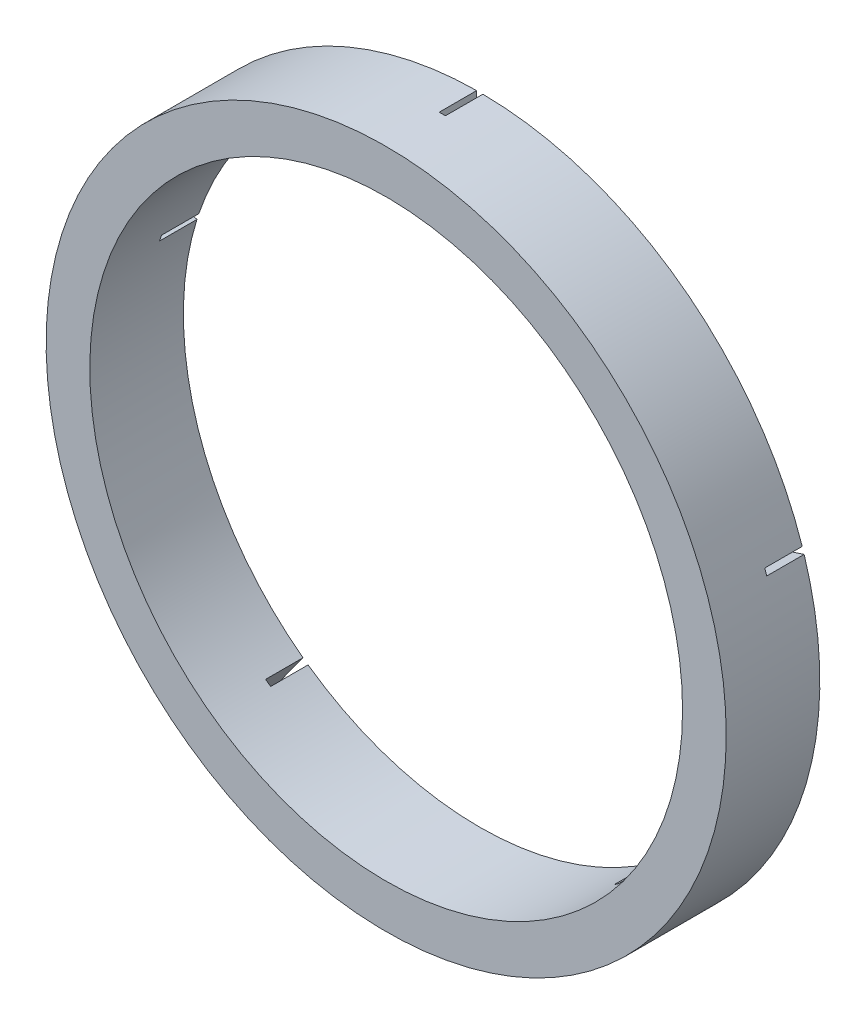
ISO-10303-21;
HEADER;
FILE_DESCRIPTION(('STEP AP214'),'2;1');
FILE_NAME('part.step','',(''),(''),'','','');
FILE_SCHEMA(('AUTOMOTIVE_DESIGN { 1 0 10303 214 1 1 1 1 }'));
ENDSEC;
DATA;
#1=APPLICATION_CONTEXT('core data for automotive mechanical design processes');
#2=APPLICATION_PROTOCOL_DEFINITION('international standard','automotive_design',2000,#1);
#3=PRODUCT_CONTEXT('',#1,'mechanical');
#4=PRODUCT('Part','Part','',(#3));
#5=PRODUCT_RELATED_PRODUCT_CATEGORY('part','',(#4));
#6=PRODUCT_DEFINITION_FORMATION('','',#4);
#7=PRODUCT_DEFINITION_CONTEXT('part definition',#1,'design');
#8=PRODUCT_DEFINITION('design','',#6,#7);
#9=PRODUCT_DEFINITION_SHAPE('','',#8);
#10=(LENGTH_UNIT() NAMED_UNIT(*) SI_UNIT(.MILLI.,.METRE.));
#11=(NAMED_UNIT(*) PLANE_ANGLE_UNIT() SI_UNIT($,.RADIAN.));
#12=(NAMED_UNIT(*) SI_UNIT($,.STERADIAN.) SOLID_ANGLE_UNIT());
#13=UNCERTAINTY_MEASURE_WITH_UNIT(LENGTH_MEASURE(1.E-05),#10,'distance_accuracy_value','');
#14=(GEOMETRIC_REPRESENTATION_CONTEXT(3) GLOBAL_UNCERTAINTY_ASSIGNED_CONTEXT((#13)) GLOBAL_UNIT_ASSIGNED_CONTEXT((#10,
#11,#12)) REPRESENTATION_CONTEXT('',''));
#15=CARTESIAN_POINT('',(0.,0.,0.));
#16=DIRECTION('',(0.,0.,1.));
#17=DIRECTION('',(1.,0.,0.));
#18=AXIS2_PLACEMENT_3D('',#15,#16,#17);
#19=CARTESIAN_POINT('',(0.,0.,15.));
#20=DIRECTION('',(0.,0.,-1.));
#21=DIRECTION('',(-1.,0.,0.));
#22=AXIS2_PLACEMENT_3D('',#19,#20,#21);
#23=CYLINDRICAL_SURFACE('',#22,54.5);
#24=CARTESIAN_POINT('',(0.,0.,15.));
#25=DIRECTION('',(0.,0.,1.));
#26=DIRECTION('',(1.,0.,0.));
#27=AXIS2_PLACEMENT_3D('',#24,#25,#26);
#28=CIRCLE('',#27,54.5);
#29=CARTESIAN_POINT('',(54.5,0.,15.));
#30=VERTEX_POINT('',#29);
#31=EDGE_CURVE('E203',#30,#30,#28,.T.);
#32=ORIENTED_EDGE('',*,*,#31,.F.);
#33=EDGE_LOOP('',(#32));
#34=FACE_BOUND('',#33,.T.);
#35=DIRECTION('',(0.,0.,-1.));
#36=VECTOR('',#35,1.);
#37=CARTESIAN_POINT('',(0.5,54.4977063737548,15.));
#38=LINE('',#37,#36);
#39=CARTESIAN_POINT('',(0.5,54.4977063737548,6.));
#40=VERTEX_POINT('',#39);
#41=CARTESIAN_POINT('',(0.5,54.4977063737548,0.));
#42=VERTEX_POINT('',#41);
#43=EDGE_CURVE('E301',#40,#42,#38,.T.);
#44=ORIENTED_EDGE('',*,*,#43,.F.);
#45=CARTESIAN_POINT('',(0.,0.,6.));
#46=DIRECTION('',(0.,0.,-1.));
#47=DIRECTION('',(-1.,0.,0.));
#48=AXIS2_PLACEMENT_3D('',#45,#46,#47);
#49=CIRCLE('',#48,54.5);
#50=CARTESIAN_POINT('',(-0.5,54.4977063737548,6.));
#51=VERTEX_POINT('',#50);
#52=EDGE_CURVE('E186',#51,#40,#49,.T.);
#53=ORIENTED_EDGE('',*,*,#52,.F.);
#54=DIRECTION('',(0.,0.,-1.));
#55=VECTOR('',#54,1.);
#56=CARTESIAN_POINT('',(-0.5,54.4977063737548,15.));
#57=LINE('',#56,#55);
#58=CARTESIAN_POINT('',(-0.5,54.4977063737548,0.));
#59=VERTEX_POINT('',#58);
#60=EDGE_CURVE('E173',#51,#59,#57,.T.);
#61=ORIENTED_EDGE('',*,*,#60,.T.);
#62=CARTESIAN_POINT('',(0.,0.,0.));
#63=DIRECTION('',(0.,0.,1.));
#64=DIRECTION('',(1.,0.,0.));
#65=AXIS2_PLACEMENT_3D('',#62,#63,#64);
#66=CIRCLE('',#65,54.5);
#67=CARTESIAN_POINT('',(-51.6758902727109,17.316245682097,0.));
#68=VERTEX_POINT('',#67);
#69=EDGE_CURVE('E184',#59,#68,#66,.T.);
#70=ORIENTED_EDGE('',*,*,#69,.T.);
#71=DIRECTION('',(0.,0.,-1.));
#72=VECTOR('',#71,1.);
#73=CARTESIAN_POINT('',(-51.6758902727109,17.316245682097,15.));
#74=LINE('',#73,#72);
#75=CARTESIAN_POINT('',(-51.6758902727109,17.316245682097,6.));
#76=VERTEX_POINT('',#75);
#77=EDGE_CURVE('E320',#76,#68,#74,.T.);
#78=ORIENTED_EDGE('',*,*,#77,.F.);
#79=CARTESIAN_POINT('',(0.,0.,6.));
#80=DIRECTION('',(0.,0.,-1.));
#81=DIRECTION('',(-1.,0.,0.));
#82=AXIS2_PLACEMENT_3D('',#79,#80,#81);
#83=CIRCLE('',#82,54.5);
#84=CARTESIAN_POINT('',(-51.9849072670859,16.3651891658019,6.));
#85=VERTEX_POINT('',#84);
#86=EDGE_CURVE('E322',#85,#76,#83,.T.);
#87=ORIENTED_EDGE('',*,*,#86,.F.);
#88=DIRECTION('',(0.,0.,-1.));
#89=VECTOR('',#88,1.);
#90=CARTESIAN_POINT('',(-51.9849072670859,16.3651891658019,15.));
#91=LINE('',#90,#89);
#92=CARTESIAN_POINT('',(-51.9849072670859,16.3651891658019,0.));
#93=VERTEX_POINT('',#92);
#94=EDGE_CURVE('E314',#85,#93,#91,.T.);
#95=ORIENTED_EDGE('',*,*,#94,.T.);
#96=CARTESIAN_POINT('',(-32.4374565874536,-43.7956779846718,0.));
#97=VERTEX_POINT('',#96);
#98=EDGE_CURVE('E194',#93,#97,#66,.T.);
#99=ORIENTED_EDGE('',*,*,#98,.T.);
#100=DIRECTION('',(0.,0.,-1.));
#101=VECTOR('',#100,1.);
#102=CARTESIAN_POINT('',(-32.4374565874536,-43.7956779846718,6.));
#103=LINE('',#102,#101);
#104=CARTESIAN_POINT('',(-32.4374565874536,-43.7956779846718,6.));
#105=VERTEX_POINT('',#104);
#106=EDGE_CURVE('E265',#105,#97,#103,.T.);
#107=ORIENTED_EDGE('',*,*,#106,.F.);
#108=CARTESIAN_POINT('',(0.,0.,6.));
#109=DIRECTION('',(0.,0.,-1.));
#110=DIRECTION('',(-1.,0.,0.));
#111=AXIS2_PLACEMENT_3D('',#108,#109,#110);
#112=CIRCLE('',#111,54.5);
#113=CARTESIAN_POINT('',(-31.6284395930788,-44.3834632369644,6.));
#114=VERTEX_POINT('',#113);
#115=EDGE_CURVE('E260',#114,#105,#112,.T.);
#116=ORIENTED_EDGE('',*,*,#115,.F.);
#117=DIRECTION('',(0.,0.,-1.));
#118=VECTOR('',#117,1.);
#119=CARTESIAN_POINT('',(-31.6284395930788,-44.3834632369644,6.));
#120=LINE('',#119,#118);
#121=CARTESIAN_POINT('',(-31.6284395930788,-44.3834632369644,0.));
#122=VERTEX_POINT('',#121);
#123=EDGE_CURVE('E269',#114,#122,#120,.T.);
#124=ORIENTED_EDGE('',*,*,#123,.T.);
#125=CARTESIAN_POINT('',(31.6284395930634,-44.3834632369753,0.));
#126=VERTEX_POINT('',#125);
#127=EDGE_CURVE('E196',#122,#126,#66,.T.);
#128=ORIENTED_EDGE('',*,*,#127,.T.);
#129=DIRECTION('',(0.,0.,-1.));
#130=VECTOR('',#129,1.);
#131=CARTESIAN_POINT('',(31.6284395930634,-44.3834632369753,15.));
#132=LINE('',#131,#130);
#133=CARTESIAN_POINT('',(31.6284395930634,-44.3834632369753,6.));
#134=VERTEX_POINT('',#133);
#135=EDGE_CURVE('E229',#134,#126,#132,.T.);
#136=ORIENTED_EDGE('',*,*,#135,.F.);
#137=CARTESIAN_POINT('',(0.,0.,6.));
#138=DIRECTION('',(0.,0.,-1.));
#139=DIRECTION('',(-1.,0.,0.));
#140=AXIS2_PLACEMENT_3D('',#137,#138,#139);
#141=CIRCLE('',#140,54.5);
#142=CARTESIAN_POINT('',(32.4374565874385,-43.7956779846829,6.));
#143=VERTEX_POINT('',#142);
#144=EDGE_CURVE('E330',#143,#134,#141,.T.);
#145=ORIENTED_EDGE('',*,*,#144,.F.);
#146=DIRECTION('',(0.,0.,-1.));
#147=VECTOR('',#146,1.);
#148=CARTESIAN_POINT('',(32.4374565874385,-43.795677984683,15.));
#149=LINE('',#148,#147);
#150=CARTESIAN_POINT('',(32.4374565874385,-43.7956779846829,0.));
#151=VERTEX_POINT('',#150);
#152=EDGE_CURVE('E216',#143,#151,#149,.T.);
#153=ORIENTED_EDGE('',*,*,#152,.T.);
#154=CARTESIAN_POINT('',(51.984907267088,16.3651891657951,0.));
#155=VERTEX_POINT('',#154);
#156=EDGE_CURVE('E198',#151,#155,#66,.T.);
#157=ORIENTED_EDGE('',*,*,#156,.T.);
#158=DIRECTION('',(0.,0.,-1.));
#159=VECTOR('',#158,1.);
#160=CARTESIAN_POINT('',(51.984907267088,16.3651891657951,6.));
#161=LINE('',#160,#159);
#162=CARTESIAN_POINT('',(51.984907267088,16.3651891657951,6.));
#163=VERTEX_POINT('',#162);
#164=EDGE_CURVE('E214',#163,#155,#161,.T.);
#165=ORIENTED_EDGE('',*,*,#164,.F.);
#166=CARTESIAN_POINT('',(0.,0.,6.));
#167=DIRECTION('',(0.,0.,-1.));
#168=DIRECTION('',(-1.,0.,0.));
#169=AXIS2_PLACEMENT_3D('',#166,#167,#168);
#170=CIRCLE('',#169,54.5);
#171=CARTESIAN_POINT('',(51.6758902727132,17.3162456820902,6.));
#172=VERTEX_POINT('',#171);
#173=EDGE_CURVE('E242',#172,#163,#170,.T.);
#174=ORIENTED_EDGE('',*,*,#173,.F.);
#175=DIRECTION('',(0.,0.,-1.));
#176=VECTOR('',#175,1.);
#177=CARTESIAN_POINT('',(51.6758902727132,17.3162456820902,6.));
#178=LINE('',#177,#176);
#179=CARTESIAN_POINT('',(51.6758902727132,17.3162456820902,0.));
#180=VERTEX_POINT('',#179);
#181=EDGE_CURVE('E228',#172,#180,#178,.T.);
#182=ORIENTED_EDGE('',*,*,#181,.T.);
#183=EDGE_CURVE('E193',#180,#42,#66,.T.);
#184=ORIENTED_EDGE('',*,*,#183,.T.);
#185=EDGE_LOOP('',(#44,#53,#61,#70,#78,#87,#95,#99,#107,#116,#124,#128,#136,#145,#153,#157,#165,
#174,#182,#184));
#186=FACE_BOUND('',#185,.T.);
#187=ADVANCED_FACE('F35',(#34,#186),#23,.T.);
#188=CARTESIAN_POINT('',(0.,0.,15.));
#189=DIRECTION('',(0.,0.,-1.));
#190=DIRECTION('',(-1.,0.,0.));
#191=AXIS2_PLACEMENT_3D('',#188,#189,#190);
#192=CYLINDRICAL_SURFACE('',#191,47.5);
#193=CARTESIAN_POINT('',(0.,0.,15.));
#194=DIRECTION('',(0.,0.,1.));
#195=DIRECTION('',(1.,0.,0.));
#196=AXIS2_PLACEMENT_3D('',#193,#194,#195);
#197=CIRCLE('',#196,47.5);
#198=CARTESIAN_POINT('',(47.5,0.,15.));
#199=VERTEX_POINT('',#198);
#200=EDGE_CURVE('E199',#199,#199,#197,.T.);
#201=ORIENTED_EDGE('',*,*,#200,.T.);
#202=EDGE_LOOP('',(#201));
#203=FACE_BOUND('',#202,.T.);
#204=CARTESIAN_POINT('',(0.,0.,6.));
#205=DIRECTION('',(0.,0.,-1.));
#206=DIRECTION('',(-1.,0.,0.));
#207=AXIS2_PLACEMENT_3D('',#204,#205,#206);
#208=CIRCLE('',#207,47.5);
#209=CARTESIAN_POINT('',(-0.5,47.4973683481517,6.));
#210=VERTEX_POINT('',#209);
#211=CARTESIAN_POINT('',(0.5,47.4973683481517,6.));
#212=VERTEX_POINT('',#211);
#213=EDGE_CURVE('E11',#210,#212,#208,.T.);
#214=ORIENTED_EDGE('',*,*,#213,.T.);
#215=DIRECTION('',(0.,0.,-1.));
#216=VECTOR('',#215,1.);
#217=CARTESIAN_POINT('',(0.5,47.4973683481517,15.));
#218=LINE('',#217,#216);
#219=CARTESIAN_POINT('',(0.5,47.4973683481517,0.));
#220=VERTEX_POINT('',#219);
#221=EDGE_CURVE('E187',#212,#220,#218,.T.);
#222=ORIENTED_EDGE('',*,*,#221,.T.);
#223=CARTESIAN_POINT('',(0.,0.,0.));
#224=DIRECTION('',(0.,0.,1.));
#225=DIRECTION('',(1.,0.,0.));
#226=AXIS2_PLACEMENT_3D('',#223,#224,#225);
#227=CIRCLE('',#226,47.5);
#228=CARTESIAN_POINT('',(45.0181731771945,15.1530222658097,0.));
#229=VERTEX_POINT('',#228);
#230=EDGE_CURVE('E280',#229,#220,#227,.T.);
#231=ORIENTED_EDGE('',*,*,#230,.F.);
#232=DIRECTION('',(0.,0.,-1.));
#233=VECTOR('',#232,1.);
#234=CARTESIAN_POINT('',(45.0181731771945,15.1530222658097,6.));
#235=LINE('',#234,#233);
#236=CARTESIAN_POINT('',(45.0181731771945,15.1530222658097,6.));
#237=VERTEX_POINT('',#236);
#238=EDGE_CURVE('E297',#237,#229,#235,.T.);
#239=ORIENTED_EDGE('',*,*,#238,.F.);
#240=CARTESIAN_POINT('',(0.,0.,6.));
#241=DIRECTION('',(0.,0.,-1.));
#242=DIRECTION('',(-1.,0.,0.));
#243=AXIS2_PLACEMENT_3D('',#240,#241,#242);
#244=CIRCLE('',#243,47.5);
#245=CARTESIAN_POINT('',(45.3271901715694,14.2019657495145,6.));
#246=VERTEX_POINT('',#245);
#247=EDGE_CURVE('E248',#246,#237,#244,.F.);
#248=ORIENTED_EDGE('',*,*,#247,.F.);
#249=DIRECTION('',(0.,0.,-1.));
#250=VECTOR('',#249,1.);
#251=CARTESIAN_POINT('',(45.3271901715694,14.2019657495145,6.));
#252=LINE('',#251,#250);
#253=CARTESIAN_POINT('',(45.3271901715694,14.2019657495145,0.));
#254=VERTEX_POINT('',#253);
#255=EDGE_CURVE('E245',#246,#254,#252,.T.);
#256=ORIENTED_EDGE('',*,*,#255,.T.);
#257=CARTESIAN_POINT('',(28.3227611349267,-38.1322855556008,0.));
#258=VERTEX_POINT('',#257);
#259=EDGE_CURVE('E233',#258,#254,#227,.T.);
#260=ORIENTED_EDGE('',*,*,#259,.F.);
#261=DIRECTION('',(0.,0.,-1.));
#262=VECTOR('',#261,1.);
#263=CARTESIAN_POINT('',(28.3227611349267,-38.1322855556008,15.));
#264=LINE('',#263,#262);
#265=CARTESIAN_POINT('',(28.3227611349267,-38.1322855556008,6.));
#266=VERTEX_POINT('',#265);
#267=EDGE_CURVE('E347',#266,#258,#264,.T.);
#268=ORIENTED_EDGE('',*,*,#267,.F.);
#269=CARTESIAN_POINT('',(0.,0.,6.));
#270=DIRECTION('',(0.,0.,-1.));
#271=DIRECTION('',(-1.,0.,0.));
#272=AXIS2_PLACEMENT_3D('',#269,#270,#271);
#273=CIRCLE('',#272,47.5);
#274=CARTESIAN_POINT('',(27.5137441405517,-38.7200708078931,6.));
#275=VERTEX_POINT('',#274);
#276=EDGE_CURVE('E208',#266,#275,#273,.T.);
#277=ORIENTED_EDGE('',*,*,#276,.T.);
#278=DIRECTION('',(0.,0.,-1.));
#279=VECTOR('',#278,1.);
#280=CARTESIAN_POINT('',(27.5137441405517,-38.7200708078932,15.));
#281=LINE('',#280,#279);
#282=CARTESIAN_POINT('',(27.5137441405517,-38.7200708078931,0.));
#283=VERTEX_POINT('',#282);
#284=EDGE_CURVE('E351',#275,#283,#281,.T.);
#285=ORIENTED_EDGE('',*,*,#284,.T.);
#286=CARTESIAN_POINT('',(-27.513744140567,-38.7200708078823,0.));
#287=VERTEX_POINT('',#286);
#288=EDGE_CURVE('E277',#287,#283,#227,.T.);
#289=ORIENTED_EDGE('',*,*,#288,.F.);
#290=DIRECTION('',(0.,0.,-1.));
#291=VECTOR('',#290,1.);
#292=CARTESIAN_POINT('',(-27.513744140567,-38.7200708078823,6.));
#293=LINE('',#292,#291);
#294=CARTESIAN_POINT('',(-27.513744140567,-38.7200708078823,6.));
#295=VERTEX_POINT('',#294);
#296=EDGE_CURVE('E271',#295,#287,#293,.T.);
#297=ORIENTED_EDGE('',*,*,#296,.F.);
#298=CARTESIAN_POINT('',(0.,0.,6.));
#299=DIRECTION('',(0.,0.,-1.));
#300=DIRECTION('',(-1.,0.,0.));
#301=AXIS2_PLACEMENT_3D('',#298,#299,#300);
#302=CIRCLE('',#301,47.5);
#303=CARTESIAN_POINT('',(-28.3227611349418,-38.1322855555896,6.));
#304=VERTEX_POINT('',#303);
#305=EDGE_CURVE('E254',#304,#295,#302,.F.);
#306=ORIENTED_EDGE('',*,*,#305,.F.);
#307=DIRECTION('',(0.,0.,-1.));
#308=VECTOR('',#307,1.);
#309=CARTESIAN_POINT('',(-28.3227611349418,-38.1322855555896,6.));
#310=LINE('',#309,#308);
#311=CARTESIAN_POINT('',(-28.3227611349418,-38.1322855555896,0.));
#312=VERTEX_POINT('',#311);
#313=EDGE_CURVE('E262',#304,#312,#310,.T.);
#314=ORIENTED_EDGE('',*,*,#313,.T.);
#315=CARTESIAN_POINT('',(-45.3271901715673,14.2019657495214,0.));
#316=VERTEX_POINT('',#315);
#317=EDGE_CURVE('E268',#316,#312,#227,.T.);
#318=ORIENTED_EDGE('',*,*,#317,.F.);
#319=DIRECTION('',(0.,0.,-1.));
#320=VECTOR('',#319,1.);
#321=CARTESIAN_POINT('',(-45.3271901715673,14.2019657495214,15.));
#322=LINE('',#321,#320);
#323=CARTESIAN_POINT('',(-45.3271901715673,14.2019657495214,6.));
#324=VERTEX_POINT('',#323);
#325=EDGE_CURVE('E57',#324,#316,#322,.T.);
#326=ORIENTED_EDGE('',*,*,#325,.F.);
#327=CARTESIAN_POINT('',(0.,0.,6.));
#328=DIRECTION('',(0.,0.,-1.));
#329=DIRECTION('',(-1.,0.,0.));
#330=AXIS2_PLACEMENT_3D('',#327,#328,#329);
#331=CIRCLE('',#330,47.5);
#332=CARTESIAN_POINT('',(-45.0181731771922,15.1530222658165,6.));
#333=VERTEX_POINT('',#332);
#334=EDGE_CURVE('E178',#324,#333,#331,.T.);
#335=ORIENTED_EDGE('',*,*,#334,.T.);
#336=DIRECTION('',(0.,0.,-1.));
#337=VECTOR('',#336,1.);
#338=CARTESIAN_POINT('',(-45.0181731771922,15.1530222658165,15.));
#339=LINE('',#338,#337);
#340=CARTESIAN_POINT('',(-45.0181731771922,15.1530222658165,0.));
#341=VERTEX_POINT('',#340);
#342=EDGE_CURVE('E317',#333,#341,#339,.T.);
#343=ORIENTED_EDGE('',*,*,#342,.T.);
#344=CARTESIAN_POINT('',(-0.5,47.4973683481517,0.));
#345=VERTEX_POINT('',#344);
#346=EDGE_CURVE('E279',#345,#341,#227,.T.);
#347=ORIENTED_EDGE('',*,*,#346,.F.);
#348=DIRECTION('',(0.,0.,-1.));
#349=VECTOR('',#348,1.);
#350=CARTESIAN_POINT('',(-0.5,47.4973683481517,15.));
#351=LINE('',#350,#349);
#352=EDGE_CURVE('E49',#210,#345,#351,.T.);
#353=ORIENTED_EDGE('',*,*,#352,.F.);
#354=EDGE_LOOP('',(#214,#222,#231,#239,#248,#256,#260,#268,#277,#285,#289,#297,#306,#314,#318,
#326,#335,#343,#347,#353));
#355=FACE_BOUND('',#354,.T.);
#356=ADVANCED_FACE('F295',(#203,#355),#192,.F.);
#357=CARTESIAN_POINT('',(0.,0.,0.));
#358=DIRECTION('',(0.,0.,1.));
#359=DIRECTION('',(1.,0.,0.));
#360=AXIS2_PLACEMENT_3D('',#357,#358,#359);
#361=PLANE('',#360);
#362=DIRECTION('',(0.,-1.,0.));
#363=VECTOR('',#362,1.);
#364=CARTESIAN_POINT('',(0.5,0.,0.));
#365=LINE('',#364,#363);
#366=EDGE_CURVE('E42',#42,#220,#365,.T.);
#367=ORIENTED_EDGE('',*,*,#366,.F.);
#368=ORIENTED_EDGE('',*,*,#183,.F.);
#369=DIRECTION('',(0.951056516295154,0.309016994374947,0.));
#370=VECTOR('',#369,1.);
#371=CARTESIAN_POINT('',(-0.154508497186339,0.475528258144085,0.));
#372=LINE('',#371,#370);
#373=EDGE_CURVE('E235',#229,#180,#372,.T.);
#374=ORIENTED_EDGE('',*,*,#373,.F.);
#375=ORIENTED_EDGE('',*,*,#230,.T.);
#376=EDGE_LOOP('',(#367,#368,#374,#375));
#377=FACE_BOUND('',#376,.T.);
#378=ADVANCED_FACE('F290',(#377),#361,.F.);
#379=ORIENTED_EDGE('',*,*,#69,.F.);
#380=DIRECTION('',(0.,-1.,0.));
#381=VECTOR('',#380,1.);
#382=CARTESIAN_POINT('',(-0.5,0.,0.));
#383=LINE('',#382,#381);
#384=EDGE_CURVE('E170',#59,#345,#383,.T.);
#385=ORIENTED_EDGE('',*,*,#384,.T.);
#386=ORIENTED_EDGE('',*,*,#346,.T.);
#387=DIRECTION('',(0.951056516295154,-0.309016994374947,0.));
#388=VECTOR('',#387,1.);
#389=CARTESIAN_POINT('',(0.154508497188563,0.475528258150928,0.));
#390=LINE('',#389,#388);
#391=EDGE_CURVE('E192',#68,#341,#390,.T.);
#392=ORIENTED_EDGE('',*,*,#391,.F.);
#393=EDGE_LOOP('',(#379,#385,#386,#392));
#394=FACE_BOUND('',#393,.T.);
#395=ADVANCED_FACE('F190',(#394),#361,.F.);
#396=DIRECTION('',(0.587785252292473,-0.809016994374948,0.));
#397=VECTOR('',#396,1.);
#398=CARTESIAN_POINT('',(26.5117778106465,-37.3409824664908,0.));
#399=LINE('',#398,#397);
#400=EDGE_CURVE('E325',#283,#126,#399,.T.);
#401=ORIENTED_EDGE('',*,*,#400,.T.);
#402=ORIENTED_EDGE('',*,*,#127,.F.);
#403=DIRECTION('',(-0.587785252292473,-0.809016994374947,0.));
#404=VECTOR('',#403,1.);
#405=CARTESIAN_POINT('',(0.404508497179912,-0.293892626140743,0.));
#406=LINE('',#405,#404);
#407=EDGE_CURVE('E238',#287,#122,#406,.T.);
#408=ORIENTED_EDGE('',*,*,#407,.F.);
#409=ORIENTED_EDGE('',*,*,#288,.T.);
#410=EDGE_LOOP('',(#401,#402,#408,#409));
#411=FACE_BOUND('',#410,.T.);
#412=ADVANCED_FACE('F389',(#411),#361,.F.);
#413=ORIENTED_EDGE('',*,*,#156,.F.);
#414=DIRECTION('',(0.587785252292473,-0.809016994374947,0.));
#415=VECTOR('',#414,1.);
#416=CARTESIAN_POINT('',(27.3207948050214,-36.7531972141983,0.));
#417=LINE('',#416,#415);
#418=EDGE_CURVE('E327',#258,#151,#417,.T.);
#419=ORIENTED_EDGE('',*,*,#418,.F.);
#420=ORIENTED_EDGE('',*,*,#259,.T.);
#421=DIRECTION('',(0.951056516295154,0.309016994374948,0.));
#422=VECTOR('',#421,1.);
#423=CARTESIAN_POINT('',(0.154508497188614,-0.475528258151086,0.));
#424=LINE('',#423,#422);
#425=EDGE_CURVE('E224',#254,#155,#424,.T.);
#426=ORIENTED_EDGE('',*,*,#425,.T.);
#427=EDGE_LOOP('',(#413,#419,#420,#426));
#428=FACE_BOUND('',#427,.T.);
#429=ADVANCED_FACE('F231',(#428),#361,.F.);
#430=ORIENTED_EDGE('',*,*,#98,.F.);
#431=DIRECTION('',(0.951056516295154,-0.309016994374948,0.));
#432=VECTOR('',#431,1.);
#433=CARTESIAN_POINT('',(-0.154508497186391,-0.475528258144245,0.));
#434=LINE('',#433,#432);
#435=EDGE_CURVE('E353',#93,#316,#434,.T.);
#436=ORIENTED_EDGE('',*,*,#435,.T.);
#437=ORIENTED_EDGE('',*,*,#317,.T.);
#438=DIRECTION('',(-0.587785252292474,-0.809016994374947,0.));
#439=VECTOR('',#438,1.);
#440=CARTESIAN_POINT('',(-0.40450849719501,0.293892626151713,0.));
#441=LINE('',#440,#439);
#442=EDGE_CURVE('E234',#312,#97,#441,.T.);
#443=ORIENTED_EDGE('',*,*,#442,.T.);
#444=EDGE_LOOP('',(#430,#436,#437,#443));
#445=FACE_BOUND('',#444,.T.);
#446=ADVANCED_FACE('F379',(#445),#361,.F.);
#447=CARTESIAN_POINT('',(0.,0.,15.));
#448=DIRECTION('',(0.,0.,1.));
#449=DIRECTION('',(1.,0.,0.));
#450=AXIS2_PLACEMENT_3D('',#447,#448,#449);
#451=PLANE('',#450);
#452=ORIENTED_EDGE('',*,*,#31,.T.);
#453=EDGE_LOOP('',(#452));
#454=FACE_BOUND('',#453,.T.);
#455=ORIENTED_EDGE('',*,*,#200,.F.);
#456=EDGE_LOOP('',(#455));
#457=FACE_BOUND('',#456,.T.);
#458=ADVANCED_FACE('F414',(#454,#457),#451,.T.);
#459=CARTESIAN_POINT('',(-0.40450849719501,0.293892626151713,6.));
#460=DIRECTION('',(0.809016994374947,-0.587785252292474,0.));
#461=DIRECTION('',(0.587785252292474,0.809016994374947,0.));
#462=AXIS2_PLACEMENT_3D('',#459,#460,#461);
#463=PLANE('',#462);
#464=ORIENTED_EDGE('',*,*,#442,.F.);
#465=ORIENTED_EDGE('',*,*,#313,.F.);
#466=DIRECTION('',(-0.587785252292474,-0.809016994374947,0.));
#467=VECTOR('',#466,1.);
#468=CARTESIAN_POINT('',(-0.40450849719501,0.293892626151713,6.));
#469=LINE('',#468,#467);
#470=EDGE_CURVE('E252',#304,#105,#469,.T.);
#471=ORIENTED_EDGE('',*,*,#470,.T.);
#472=ORIENTED_EDGE('',*,*,#106,.T.);
#473=EDGE_LOOP('',(#464,#465,#471,#472));
#474=FACE_BOUND('',#473,.T.);
#475=ADVANCED_FACE('F381',(#474),#463,.T.);
#476=CARTESIAN_POINT('',(0.404508497179912,-0.293892626140743,6.));
#477=DIRECTION('',(0.809016994374947,-0.587785252292473,0.));
#478=DIRECTION('',(0.587785252292473,0.809016994374947,0.));
#479=AXIS2_PLACEMENT_3D('',#476,#477,#478);
#480=PLANE('',#479);
#481=ORIENTED_EDGE('',*,*,#407,.T.);
#482=ORIENTED_EDGE('',*,*,#123,.F.);
#483=DIRECTION('',(-0.587785252292473,-0.809016994374947,0.));
#484=VECTOR('',#483,1.);
#485=CARTESIAN_POINT('',(0.404508497179912,-0.293892626140743,6.));
#486=LINE('',#485,#484);
#487=EDGE_CURVE('E257',#295,#114,#486,.T.);
#488=ORIENTED_EDGE('',*,*,#487,.F.);
#489=ORIENTED_EDGE('',*,*,#296,.T.);
#490=EDGE_LOOP('',(#481,#482,#488,#489));
#491=FACE_BOUND('',#490,.T.);
#492=ADVANCED_FACE('F388',(#491),#480,.F.);
#493=CARTESIAN_POINT('',(0.,0.,6.));
#494=DIRECTION('',(0.,0.,-1.));
#495=DIRECTION('',(-1.,0.,0.));
#496=AXIS2_PLACEMENT_3D('',#493,#494,#495);
#497=PLANE('',#496);
#498=ORIENTED_EDGE('',*,*,#470,.F.);
#499=ORIENTED_EDGE('',*,*,#305,.T.);
#500=ORIENTED_EDGE('',*,*,#487,.T.);
#501=ORIENTED_EDGE('',*,*,#115,.T.);
#502=EDGE_LOOP('',(#498,#499,#500,#501));
#503=FACE_BOUND('',#502,.T.);
#504=ADVANCED_FACE('F385',(#503),#497,.T.);
#505=CARTESIAN_POINT('',(0.154508497188614,-0.475528258151086,6.));
#506=DIRECTION('',(-0.309016994374948,0.951056516295153,0.));
#507=DIRECTION('',(-0.951056516295154,-0.309016994374948,0.));
#508=AXIS2_PLACEMENT_3D('',#505,#506,#507);
#509=PLANE('',#508);
#510=ORIENTED_EDGE('',*,*,#425,.F.);
#511=ORIENTED_EDGE('',*,*,#255,.F.);
#512=DIRECTION('',(0.951056516295154,0.309016994374948,0.));
#513=VECTOR('',#512,1.);
#514=CARTESIAN_POINT('',(0.154508497188614,-0.475528258151086,6.));
#515=LINE('',#514,#513);
#516=EDGE_CURVE('E226',#246,#163,#515,.T.);
#517=ORIENTED_EDGE('',*,*,#516,.T.);
#518=ORIENTED_EDGE('',*,*,#164,.T.);
#519=EDGE_LOOP('',(#510,#511,#517,#518));
#520=FACE_BOUND('',#519,.T.);
#521=ADVANCED_FACE('F222',(#520),#509,.T.);
#522=CARTESIAN_POINT('',(-0.154508497186339,0.475528258144085,6.));
#523=DIRECTION('',(-0.309016994374947,0.951056516295154,0.));
#524=DIRECTION('',(-0.951056516295154,-0.309016994374947,0.));
#525=AXIS2_PLACEMENT_3D('',#522,#523,#524);
#526=PLANE('',#525);
#527=ORIENTED_EDGE('',*,*,#373,.T.);
#528=ORIENTED_EDGE('',*,*,#181,.F.);
#529=DIRECTION('',(0.951056516295154,0.309016994374947,0.));
#530=VECTOR('',#529,1.);
#531=CARTESIAN_POINT('',(-0.154508497186339,0.475528258144085,6.));
#532=LINE('',#531,#530);
#533=EDGE_CURVE('E244',#237,#172,#532,.T.);
#534=ORIENTED_EDGE('',*,*,#533,.F.);
#535=ORIENTED_EDGE('',*,*,#238,.T.);
#536=EDGE_LOOP('',(#527,#528,#534,#535));
#537=FACE_BOUND('',#536,.T.);
#538=ADVANCED_FACE('F342',(#537),#526,.F.);
#539=CARTESIAN_POINT('',(0.,0.,6.));
#540=DIRECTION('',(0.,0.,-1.));
#541=DIRECTION('',(-1.,0.,0.));
#542=AXIS2_PLACEMENT_3D('',#539,#540,#541);
#543=PLANE('',#542);
#544=ORIENTED_EDGE('',*,*,#516,.F.);
#545=ORIENTED_EDGE('',*,*,#247,.T.);
#546=ORIENTED_EDGE('',*,*,#533,.T.);
#547=ORIENTED_EDGE('',*,*,#173,.T.);
#548=EDGE_LOOP('',(#544,#545,#546,#547));
#549=FACE_BOUND('',#548,.T.);
#550=ADVANCED_FACE('F344',(#549),#543,.T.);
#551=CARTESIAN_POINT('',(26.5117778106465,-37.3409824664908,6.));
#552=DIRECTION('',(0.809016994374948,0.587785252292473,0.));
#553=DIRECTION('',(-0.587785252292473,0.809016994374948,0.));
#554=AXIS2_PLACEMENT_3D('',#551,#552,#553);
#555=PLANE('',#554);
#556=ORIENTED_EDGE('',*,*,#135,.T.);
#557=ORIENTED_EDGE('',*,*,#400,.F.);
#558=ORIENTED_EDGE('',*,*,#284,.F.);
#559=DIRECTION('',(0.587785252292473,-0.809016994374948,0.));
#560=VECTOR('',#559,1.);
#561=CARTESIAN_POINT('',(26.5117778106465,-37.3409824664908,6.));
#562=LINE('',#561,#560);
#563=EDGE_CURVE('E324',#275,#134,#562,.T.);
#564=ORIENTED_EDGE('',*,*,#563,.T.);
#565=EDGE_LOOP('',(#556,#557,#558,#564));
#566=FACE_BOUND('',#565,.T.);
#567=ADVANCED_FACE('F392',(#566),#555,.T.);
#568=CARTESIAN_POINT('',(27.3207948050214,-36.7531972141983,6.));
#569=DIRECTION('',(0.809016994374947,0.587785252292473,0.));
#570=DIRECTION('',(-0.587785252292473,0.809016994374947,0.));
#571=AXIS2_PLACEMENT_3D('',#568,#569,#570);
#572=PLANE('',#571);
#573=DIRECTION('',(0.587785252292473,-0.809016994374947,0.));
#574=VECTOR('',#573,1.);
#575=CARTESIAN_POINT('',(27.3207948050214,-36.7531972141983,6.));
#576=LINE('',#575,#574);
#577=EDGE_CURVE('E328',#266,#143,#576,.T.);
#578=ORIENTED_EDGE('',*,*,#577,.F.);
#579=ORIENTED_EDGE('',*,*,#267,.T.);
#580=ORIENTED_EDGE('',*,*,#418,.T.);
#581=ORIENTED_EDGE('',*,*,#152,.F.);
#582=EDGE_LOOP('',(#578,#579,#580,#581));
#583=FACE_BOUND('',#582,.T.);
#584=ADVANCED_FACE('F395',(#583),#572,.F.);
#585=CARTESIAN_POINT('',(0.,0.,6.));
#586=DIRECTION('',(0.,0.,-1.));
#587=DIRECTION('',(-1.,0.,0.));
#588=AXIS2_PLACEMENT_3D('',#585,#586,#587);
#589=PLANE('',#588);
#590=ORIENTED_EDGE('',*,*,#144,.T.);
#591=ORIENTED_EDGE('',*,*,#563,.F.);
#592=ORIENTED_EDGE('',*,*,#276,.F.);
#593=ORIENTED_EDGE('',*,*,#577,.T.);
#594=EDGE_LOOP('',(#590,#591,#592,#593));
#595=FACE_BOUND('',#594,.T.);
#596=ADVANCED_FACE('F394',(#595),#589,.T.);
#597=CARTESIAN_POINT('',(0.,0.,6.));
#598=DIRECTION('',(0.,0.,-1.));
#599=DIRECTION('',(-1.,0.,0.));
#600=AXIS2_PLACEMENT_3D('',#597,#598,#599);
#601=PLANE('',#600);
#602=ORIENTED_EDGE('',*,*,#86,.T.);
#603=DIRECTION('',(-0.951056516295154,0.309016994374947,0.));
#604=VECTOR('',#603,1.);
#605=CARTESIAN_POINT('',(-43.3969575998301,14.6262573928919,6.));
#606=LINE('',#605,#604);
#607=EDGE_CURVE('E307',#333,#76,#606,.T.);
#608=ORIENTED_EDGE('',*,*,#607,.F.);
#609=ORIENTED_EDGE('',*,*,#334,.F.);
#610=DIRECTION('',(-0.951056516295154,0.309016994374948,0.));
#611=VECTOR('',#610,1.);
#612=CARTESIAN_POINT('',(-43.705974594205,13.6752008765968,6.));
#613=LINE('',#612,#611);
#614=EDGE_CURVE('E310',#324,#85,#613,.T.);
#615=ORIENTED_EDGE('',*,*,#614,.T.);
#616=EDGE_LOOP('',(#602,#608,#609,#615));
#617=FACE_BOUND('',#616,.T.);
#618=ADVANCED_FACE('F372',(#617),#601,.T.);
#619=CARTESIAN_POINT('',(-43.3969575998301,14.6262573928919,6.));
#620=DIRECTION('',(-0.309016994374947,-0.951056516295154,0.));
#621=DIRECTION('',(0.951056516295154,-0.309016994374947,0.));
#622=AXIS2_PLACEMENT_3D('',#619,#620,#621);
#623=PLANE('',#622);
#624=ORIENTED_EDGE('',*,*,#77,.T.);
#625=ORIENTED_EDGE('',*,*,#391,.T.);
#626=ORIENTED_EDGE('',*,*,#342,.F.);
#627=ORIENTED_EDGE('',*,*,#607,.T.);
#628=EDGE_LOOP('',(#624,#625,#626,#627));
#629=FACE_BOUND('',#628,.T.);
#630=ADVANCED_FACE('F367',(#629),#623,.T.);
#631=CARTESIAN_POINT('',(-43.705974594205,13.6752008765968,6.));
#632=DIRECTION('',(-0.309016994374948,-0.951056516295153,0.));
#633=DIRECTION('',(0.951056516295154,-0.309016994374948,0.));
#634=AXIS2_PLACEMENT_3D('',#631,#632,#633);
#635=PLANE('',#634);
#636=ORIENTED_EDGE('',*,*,#614,.F.);
#637=ORIENTED_EDGE('',*,*,#325,.T.);
#638=ORIENTED_EDGE('',*,*,#435,.F.);
#639=ORIENTED_EDGE('',*,*,#94,.F.);
#640=EDGE_LOOP('',(#636,#637,#638,#639));
#641=FACE_BOUND('',#640,.T.);
#642=ADVANCED_FACE('F373',(#641),#635,.F.);
#643=CARTESIAN_POINT('',(0.,0.,6.));
#644=DIRECTION('',(0.,0.,-1.));
#645=DIRECTION('',(-1.,0.,0.));
#646=AXIS2_PLACEMENT_3D('',#643,#644,#645);
#647=PLANE('',#646);
#648=ORIENTED_EDGE('',*,*,#52,.T.);
#649=DIRECTION('',(0.,1.,0.));
#650=VECTOR('',#649,1.);
#651=CARTESIAN_POINT('',(0.5,45.7927214112037,6.));
#652=LINE('',#651,#650);
#653=EDGE_CURVE('E360',#212,#40,#652,.T.);
#654=ORIENTED_EDGE('',*,*,#653,.F.);
#655=ORIENTED_EDGE('',*,*,#213,.F.);
#656=DIRECTION('',(0.,1.,0.));
#657=VECTOR('',#656,1.);
#658=CARTESIAN_POINT('',(-0.5,45.7927214112037,6.));
#659=LINE('',#658,#657);
#660=EDGE_CURVE('E362',#210,#51,#659,.T.);
#661=ORIENTED_EDGE('',*,*,#660,.T.);
#662=EDGE_LOOP('',(#648,#654,#655,#661));
#663=FACE_BOUND('',#662,.T.);
#664=ADVANCED_FACE('F365',(#663),#647,.T.);
#665=CARTESIAN_POINT('',(0.5,45.7927214112037,6.));
#666=DIRECTION('',(-1.,0.,0.));
#667=DIRECTION('',(0.,0.,1.));
#668=AXIS2_PLACEMENT_3D('',#665,#666,#667);
#669=PLANE('',#668);
#670=ORIENTED_EDGE('',*,*,#43,.T.);
#671=ORIENTED_EDGE('',*,*,#366,.T.);
#672=ORIENTED_EDGE('',*,*,#221,.F.);
#673=ORIENTED_EDGE('',*,*,#653,.T.);
#674=EDGE_LOOP('',(#670,#671,#672,#673));
#675=FACE_BOUND('',#674,.T.);
#676=ADVANCED_FACE('F359',(#675),#669,.T.);
#677=CARTESIAN_POINT('',(-0.5,45.7927214112037,6.));
#678=DIRECTION('',(-1.,0.,0.));
#679=DIRECTION('',(0.,0.,1.));
#680=AXIS2_PLACEMENT_3D('',#677,#678,#679);
#681=PLANE('',#680);
#682=ORIENTED_EDGE('',*,*,#660,.F.);
#683=ORIENTED_EDGE('',*,*,#352,.T.);
#684=ORIENTED_EDGE('',*,*,#384,.F.);
#685=ORIENTED_EDGE('',*,*,#60,.F.);
#686=EDGE_LOOP('',(#682,#683,#684,#685));
#687=FACE_BOUND('',#686,.T.);
#688=ADVANCED_FACE('F172',(#687),#681,.F.);
#689=CLOSED_SHELL('',(#187,#356,#378,#395,#412,#429,#446,#458,#475,#492,#504,#521,#538,#550,
#567,#584,#596,#618,#630,#642,#664,#676,#688));
#690=MANIFOLD_SOLID_BREP('B2',#689);
#691=ADVANCED_BREP_SHAPE_REPRESENTATION('',(#18,#690),#14);
#692=SHAPE_DEFINITION_REPRESENTATION(#9,#691);
ENDSEC;
END-ISO-10303-21;
